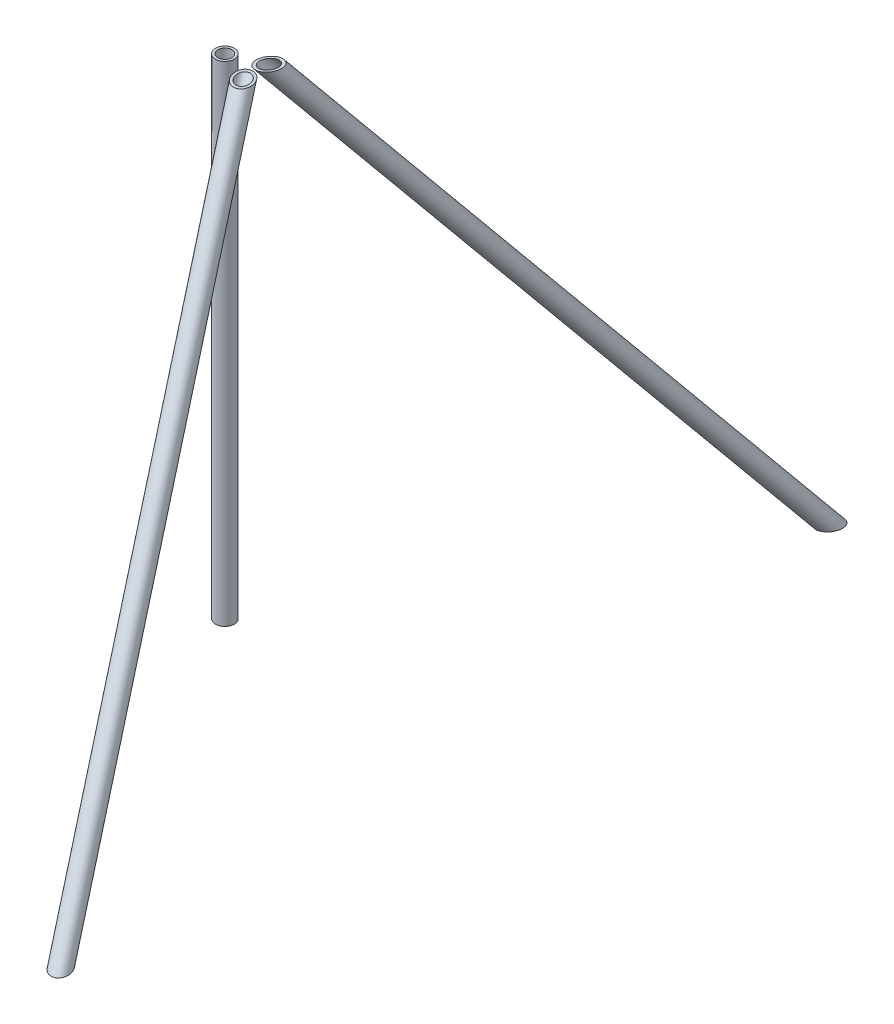
ISO-10303-21;
HEADER;
FILE_DESCRIPTION(('STEP AP214'),'2;1');
FILE_NAME('part.step','',(''),(''),'','','');
FILE_SCHEMA(('AUTOMOTIVE_DESIGN { 1 0 10303 214 1 1 1 1 }'));
ENDSEC;
DATA;
#1=APPLICATION_CONTEXT('core data for automotive mechanical design processes');
#2=APPLICATION_PROTOCOL_DEFINITION('international standard','automotive_design',2000,#1);
#3=PRODUCT_CONTEXT('',#1,'mechanical');
#4=PRODUCT('Part','Part','',(#3));
#5=PRODUCT_RELATED_PRODUCT_CATEGORY('part','',(#4));
#6=PRODUCT_DEFINITION_FORMATION('','',#4);
#7=PRODUCT_DEFINITION_CONTEXT('part definition',#1,'design');
#8=PRODUCT_DEFINITION('design','',#6,#7);
#9=PRODUCT_DEFINITION_SHAPE('','',#8);
#10=(LENGTH_UNIT() NAMED_UNIT(*) SI_UNIT(.MILLI.,.METRE.));
#11=(NAMED_UNIT(*) PLANE_ANGLE_UNIT() SI_UNIT($,.RADIAN.));
#12=(NAMED_UNIT(*) SI_UNIT($,.STERADIAN.) SOLID_ANGLE_UNIT());
#13=UNCERTAINTY_MEASURE_WITH_UNIT(LENGTH_MEASURE(1.E-05),#10,'distance_accuracy_value','');
#14=(GEOMETRIC_REPRESENTATION_CONTEXT(3) GLOBAL_UNCERTAINTY_ASSIGNED_CONTEXT((#13)) GLOBAL_UNIT_ASSIGNED_CONTEXT((#10,
#11,#12)) REPRESENTATION_CONTEXT('',''));
#15=CARTESIAN_POINT('',(0.,0.,0.));
#16=DIRECTION('',(0.,0.,1.));
#17=DIRECTION('',(1.,0.,0.));
#18=AXIS2_PLACEMENT_3D('',#15,#16,#17);
#19=CARTESIAN_POINT('',(13.9451292699681,21.4064950581311,5.14431936018456));
#20=DIRECTION('',(0.294383710597585,-0.761089593252292,-0.577997285441599));
#21=DIRECTION('',(0.,-0.604797490267115,0.796379303954214));
#22=AXIS2_PLACEMENT_3D('',#19,#20,#21);
#23=CYLINDRICAL_SURFACE('',#22,4.699);
#24=CARTESIAN_POINT('',(20.9969339622641,3.175,-8.70129716981126));
#25=DIRECTION('',(0.,-1.,0.));
#26=DIRECTION('',(0.453842868921282,0.,-0.891081730443005));
#27=AXIS2_PLACEMENT_3D('',#24,#25,#26);
#28=ELLIPSE('',#27,6.17404316346018,4.699);
#29=CARTESIAN_POINT('',(23.7989794244127,3.175,-14.2028742357372));
#30=VERTEX_POINT('',#29);
#31=EDGE_CURVE('E53',#30,#30,#28,.T.);
#32=ORIENTED_EDGE('',*,*,#31,.F.);
#33=EDGE_LOOP('',(#32));
#34=FACE_BOUND('',#33,.T.);
#35=CARTESIAN_POINT('',(148.715801886792,-327.025,-259.466391509434));
#36=DIRECTION('',(0.,-1.,0.));
#37=DIRECTION('',(0.453842868921282,0.,-0.891081730443005));
#38=AXIS2_PLACEMENT_3D('',#35,#36,#37);
#39=ELLIPSE('',#38,6.17404316346018,4.699);
#40=CARTESIAN_POINT('',(151.517847348941,-327.025,-264.96796857536));
#41=VERTEX_POINT('',#40);
#42=EDGE_CURVE('E58',#41,#41,#39,.T.);
#43=ORIENTED_EDGE('',*,*,#42,.T.);
#44=EDGE_LOOP('',(#43));
#45=FACE_BOUND('',#44,.T.);
#46=ADVANCED_FACE('F45',(#34,#45),#23,.F.);
#47=CARTESIAN_POINT('',(13.9451292699681,21.4064950581311,5.14431936018456));
#48=DIRECTION('',(0.294383710597585,-0.761089593252292,-0.577997285441599));
#49=DIRECTION('',(0.,-0.604797490267115,0.796379303954214));
#50=AXIS2_PLACEMENT_3D('',#47,#48,#49);
#51=CYLINDRICAL_SURFACE('',#50,6.35000000000001);
#52=CARTESIAN_POINT('',(20.9969339622641,3.175,-8.70129716981126));
#53=DIRECTION('',(0.,-1.,0.));
#54=DIRECTION('',(0.453842868921282,0.,-0.891081730443005));
#55=AXIS2_PLACEMENT_3D('',#52,#53,#54);
#56=ELLIPSE('',#55,8.3433015722435,6.35000000000001);
#57=CARTESIAN_POINT('',(24.7834818840866,3.175,-16.1358607724138));
#58=VERTEX_POINT('',#57);
#59=EDGE_CURVE('E12',#58,#58,#56,.T.);
#60=ORIENTED_EDGE('',*,*,#59,.T.);
#61=EDGE_LOOP('',(#60));
#62=FACE_BOUND('',#61,.T.);
#63=CARTESIAN_POINT('',(148.715801886792,-327.025,-259.466391509434));
#64=DIRECTION('',(0.,-1.,0.));
#65=DIRECTION('',(0.453842868921282,0.,-0.891081730443005));
#66=AXIS2_PLACEMENT_3D('',#63,#64,#65);
#67=ELLIPSE('',#66,8.3433015722435,6.35000000000001);
#68=CARTESIAN_POINT('',(152.502349808615,-327.025,-266.900955112037));
#69=VERTEX_POINT('',#68);
#70=EDGE_CURVE('E49',#69,#69,#67,.T.);
#71=ORIENTED_EDGE('',*,*,#70,.F.);
#72=EDGE_LOOP('',(#71));
#73=FACE_BOUND('',#72,.T.);
#74=ADVANCED_FACE('F68',(#62,#73),#51,.T.);
#75=CARTESIAN_POINT('',(0.,3.175,0.));
#76=DIRECTION('',(0.,1.,0.));
#77=DIRECTION('',(0.,0.,-1.));
#78=AXIS2_PLACEMENT_3D('',#75,#76,#77);
#79=PLANE('',#78);
#80=ORIENTED_EDGE('',*,*,#31,.T.);
#81=EDGE_LOOP('',(#80));
#82=FACE_BOUND('',#81,.T.);
#83=ORIENTED_EDGE('',*,*,#59,.F.);
#84=EDGE_LOOP('',(#83));
#85=FACE_BOUND('',#84,.T.);
#86=ADVANCED_FACE('F47',(#82,#85),#79,.T.);
#87=CARTESIAN_POINT('',(154.269336562295,-327.025,-270.370282762554));
#88=DIRECTION('',(0.,-1.,0.));
#89=DIRECTION('',(0.,0.,-1.));
#90=AXIS2_PLACEMENT_3D('',#87,#88,#89);
#91=PLANE('',#90);
#92=ORIENTED_EDGE('',*,*,#42,.F.);
#93=EDGE_LOOP('',(#92));
#94=FACE_BOUND('',#93,.T.);
#95=ORIENTED_EDGE('',*,*,#70,.T.);
#96=EDGE_LOOP('',(#95));
#97=FACE_BOUND('',#96,.T.);
#98=ADVANCED_FACE('F66',(#94,#97),#91,.T.);
#99=CLOSED_SHELL('',(#46,#74,#86,#98));
#100=MANIFOLD_SOLID_BREP('B2',#99);
#101=CARTESIAN_POINT('',(0.,-327.025,0.));
#102=DIRECTION('',(0.,1.,0.));
#103=DIRECTION('',(0.,0.,1.));
#104=AXIS2_PLACEMENT_3D('',#101,#102,#103);
#105=CYLINDRICAL_SURFACE('',#104,6.35);
#106=CARTESIAN_POINT('',(0.,-327.025,0.));
#107=DIRECTION('',(0.,1.,0.));
#108=DIRECTION('',(0.,0.,1.));
#109=AXIS2_PLACEMENT_3D('',#106,#107,#108);
#110=CIRCLE('',#109,6.35);
#111=CARTESIAN_POINT('',(0.,-327.025,6.35));
#112=VERTEX_POINT('',#111);
#113=EDGE_CURVE('E44',#112,#112,#110,.T.);
#114=ORIENTED_EDGE('',*,*,#113,.T.);
#115=EDGE_LOOP('',(#114));
#116=FACE_BOUND('',#115,.T.);
#117=CARTESIAN_POINT('',(0.,3.175,0.));
#118=DIRECTION('',(0.,1.,0.));
#119=DIRECTION('',(0.,0.,1.));
#120=AXIS2_PLACEMENT_3D('',#117,#118,#119);
#121=CIRCLE('',#120,6.35);
#122=CARTESIAN_POINT('',(0.,3.175,6.35));
#123=VERTEX_POINT('',#122);
#124=EDGE_CURVE('E135',#123,#123,#121,.T.);
#125=ORIENTED_EDGE('',*,*,#124,.F.);
#126=EDGE_LOOP('',(#125));
#127=FACE_BOUND('',#126,.T.);
#128=ADVANCED_FACE('F132',(#116,#127),#105,.T.);
#129=CARTESIAN_POINT('',(0.,-327.025,0.));
#130=DIRECTION('',(0.,1.,0.));
#131=DIRECTION('',(0.,0.,1.));
#132=AXIS2_PLACEMENT_3D('',#129,#130,#131);
#133=PLANE('',#132);
#134=CARTESIAN_POINT('',(0.,-327.025,0.));
#135=DIRECTION('',(0.,1.,0.));
#136=DIRECTION('',(0.,0.,1.));
#137=AXIS2_PLACEMENT_3D('',#134,#135,#136);
#138=CIRCLE('',#137,4.699);
#139=CARTESIAN_POINT('',(0.,-327.025,4.699));
#140=VERTEX_POINT('',#139);
#141=EDGE_CURVE('E142',#140,#140,#138,.T.);
#142=ORIENTED_EDGE('',*,*,#141,.T.);
#143=EDGE_LOOP('',(#142));
#144=FACE_BOUND('',#143,.T.);
#145=ORIENTED_EDGE('',*,*,#113,.F.);
#146=EDGE_LOOP('',(#145));
#147=FACE_BOUND('',#146,.T.);
#148=ADVANCED_FACE('F150',(#144,#147),#133,.F.);
#149=CARTESIAN_POINT('',(0.,3.175,0.));
#150=DIRECTION('',(0.,1.,0.));
#151=DIRECTION('',(0.,0.,1.));
#152=AXIS2_PLACEMENT_3D('',#149,#150,#151);
#153=PLANE('',#152);
#154=CARTESIAN_POINT('',(0.,3.175,0.));
#155=DIRECTION('',(0.,1.,0.));
#156=DIRECTION('',(0.,0.,1.));
#157=AXIS2_PLACEMENT_3D('',#154,#155,#156);
#158=CIRCLE('',#157,4.699);
#159=CARTESIAN_POINT('',(0.,3.175,4.699));
#160=VERTEX_POINT('',#159);
#161=EDGE_CURVE('E144',#160,#160,#158,.T.);
#162=ORIENTED_EDGE('',*,*,#161,.F.);
#163=EDGE_LOOP('',(#162));
#164=FACE_BOUND('',#163,.T.);
#165=ORIENTED_EDGE('',*,*,#124,.T.);
#166=EDGE_LOOP('',(#165));
#167=FACE_BOUND('',#166,.T.);
#168=ADVANCED_FACE('F156',(#164,#167),#153,.T.);
#169=CARTESIAN_POINT('',(0.,-327.025,0.));
#170=DIRECTION('',(0.,1.,0.));
#171=DIRECTION('',(0.,0.,1.));
#172=AXIS2_PLACEMENT_3D('',#169,#170,#171);
#173=CYLINDRICAL_SURFACE('',#172,4.699);
#174=ORIENTED_EDGE('',*,*,#141,.F.);
#175=EDGE_LOOP('',(#174));
#176=FACE_BOUND('',#175,.T.);
#177=ORIENTED_EDGE('',*,*,#161,.T.);
#178=EDGE_LOOP('',(#177));
#179=FACE_BOUND('',#178,.T.);
#180=ADVANCED_FACE('F153',(#176,#179),#173,.F.);
#181=CLOSED_SHELL('',(#128,#148,#168,#180));
#182=MANIFOLD_SOLID_BREP('B7',#181);
#183=CARTESIAN_POINT('',(13.9451292699681,21.4064950581311,-5.14431936018456));
#184=DIRECTION('',(0.294383710597585,-0.761089593252292,0.577997285441599));
#185=DIRECTION('',(0.,-0.604797490267115,-0.796379303954214));
#186=AXIS2_PLACEMENT_3D('',#183,#184,#185);
#187=CYLINDRICAL_SURFACE('',#186,4.699);
#188=CARTESIAN_POINT('',(20.9969339622641,3.175,8.70129716981126));
#189=DIRECTION('',(0.,1.,0.));
#190=DIRECTION('',(0.453842868921282,0.,0.891081730443005));
#191=AXIS2_PLACEMENT_3D('',#188,#189,#190);
#192=ELLIPSE('',#191,6.17404316346018,4.699);
#193=CARTESIAN_POINT('',(23.7989794244127,3.175,14.2028742357372));
#194=VERTEX_POINT('',#193);
#195=EDGE_CURVE('E202',#194,#194,#192,.T.);
#196=ORIENTED_EDGE('',*,*,#195,.T.);
#197=EDGE_LOOP('',(#196));
#198=FACE_BOUND('',#197,.T.);
#199=CARTESIAN_POINT('',(148.715801886792,-327.025,259.466391509434));
#200=DIRECTION('',(0.,-1.,0.));
#201=DIRECTION('',(0.453842868921282,0.,0.891081730443005));
#202=AXIS2_PLACEMENT_3D('',#199,#200,#201);
#203=ELLIPSE('',#202,6.17404316346018,4.699);
#204=CARTESIAN_POINT('',(151.517847348941,-327.025,264.96796857536));
#205=VERTEX_POINT('',#204);
#206=EDGE_CURVE('E207',#205,#205,#203,.T.);
#207=ORIENTED_EDGE('',*,*,#206,.T.);
#208=EDGE_LOOP('',(#207));
#209=FACE_BOUND('',#208,.T.);
#210=ADVANCED_FACE('F194',(#198,#209),#187,.F.);
#211=CARTESIAN_POINT('',(13.9451292699681,21.4064950581311,-5.14431936018456));
#212=DIRECTION('',(0.294383710597585,-0.761089593252292,0.577997285441599));
#213=DIRECTION('',(0.,-0.604797490267115,-0.796379303954214));
#214=AXIS2_PLACEMENT_3D('',#211,#212,#213);
#215=CYLINDRICAL_SURFACE('',#214,6.35000000000001);
#216=CARTESIAN_POINT('',(20.9969339622641,3.175,8.70129716981126));
#217=DIRECTION('',(0.,1.,0.));
#218=DIRECTION('',(0.453842868921282,0.,0.891081730443005));
#219=AXIS2_PLACEMENT_3D('',#216,#217,#218);
#220=ELLIPSE('',#219,8.3433015722435,6.35000000000001);
#221=CARTESIAN_POINT('',(24.7834818840866,3.175,16.1358607724138));
#222=VERTEX_POINT('',#221);
#223=EDGE_CURVE('E131',#222,#222,#220,.T.);
#224=ORIENTED_EDGE('',*,*,#223,.F.);
#225=EDGE_LOOP('',(#224));
#226=FACE_BOUND('',#225,.T.);
#227=CARTESIAN_POINT('',(148.715801886792,-327.025,259.466391509434));
#228=DIRECTION('',(0.,-1.,0.));
#229=DIRECTION('',(0.453842868921282,0.,0.891081730443005));
#230=AXIS2_PLACEMENT_3D('',#227,#228,#229);
#231=ELLIPSE('',#230,8.3433015722435,6.35000000000001);
#232=CARTESIAN_POINT('',(152.502349808615,-327.025,266.900955112037));
#233=VERTEX_POINT('',#232);
#234=EDGE_CURVE('E198',#233,#233,#231,.T.);
#235=ORIENTED_EDGE('',*,*,#234,.F.);
#236=EDGE_LOOP('',(#235));
#237=FACE_BOUND('',#236,.T.);
#238=ADVANCED_FACE('F217',(#226,#237),#215,.T.);
#239=CARTESIAN_POINT('',(0.,3.175,0.));
#240=DIRECTION('',(0.,1.,0.));
#241=DIRECTION('',(0.,0.,1.));
#242=AXIS2_PLACEMENT_3D('',#239,#240,#241);
#243=PLANE('',#242);
#244=ORIENTED_EDGE('',*,*,#195,.F.);
#245=EDGE_LOOP('',(#244));
#246=FACE_BOUND('',#245,.T.);
#247=ORIENTED_EDGE('',*,*,#223,.T.);
#248=EDGE_LOOP('',(#247));
#249=FACE_BOUND('',#248,.T.);
#250=ADVANCED_FACE('F196',(#246,#249),#243,.T.);
#251=CARTESIAN_POINT('',(154.269336562295,-327.025,270.370282762554));
#252=DIRECTION('',(0.,-1.,0.));
#253=DIRECTION('',(0.,0.,-1.));
#254=AXIS2_PLACEMENT_3D('',#251,#252,#253);
#255=PLANE('',#254);
#256=ORIENTED_EDGE('',*,*,#206,.F.);
#257=EDGE_LOOP('',(#256));
#258=FACE_BOUND('',#257,.T.);
#259=ORIENTED_EDGE('',*,*,#234,.T.);
#260=EDGE_LOOP('',(#259));
#261=FACE_BOUND('',#260,.T.);
#262=ADVANCED_FACE('F215',(#258,#261),#255,.T.);
#263=CLOSED_SHELL('',(#210,#238,#250,#262));
#264=MANIFOLD_SOLID_BREP('B39',#263);
#265=ADVANCED_BREP_SHAPE_REPRESENTATION('',(#18,#100,#182,#264),#14);
#266=SHAPE_DEFINITION_REPRESENTATION(#9,#265);
ENDSEC;
END-ISO-10303-21;
